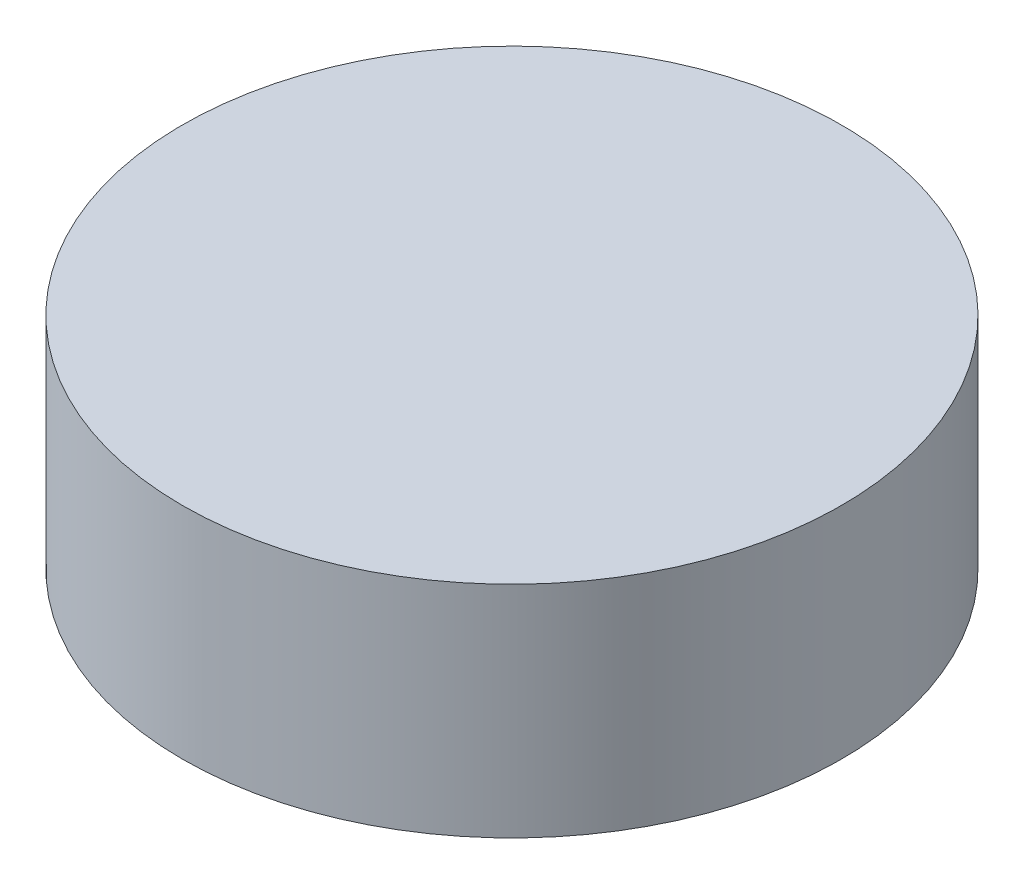
ISO-10303-21;
HEADER;
FILE_DESCRIPTION(('STEP AP214'),'2;1');
FILE_NAME('part.step','',(''),(''),'','','');
FILE_SCHEMA(('AUTOMOTIVE_DESIGN { 1 0 10303 214 1 1 1 1 }'));
ENDSEC;
DATA;
#1=APPLICATION_CONTEXT('core data for automotive mechanical design processes');
#2=APPLICATION_PROTOCOL_DEFINITION('international standard','automotive_design',2000,#1);
#3=PRODUCT_CONTEXT('',#1,'mechanical');
#4=PRODUCT('Part','Part','',(#3));
#5=PRODUCT_RELATED_PRODUCT_CATEGORY('part','',(#4));
#6=PRODUCT_DEFINITION_FORMATION('','',#4);
#7=PRODUCT_DEFINITION_CONTEXT('part definition',#1,'design');
#8=PRODUCT_DEFINITION('design','',#6,#7);
#9=PRODUCT_DEFINITION_SHAPE('','',#8);
#10=(LENGTH_UNIT() NAMED_UNIT(*) SI_UNIT(.MILLI.,.METRE.));
#11=(NAMED_UNIT(*) PLANE_ANGLE_UNIT() SI_UNIT($,.RADIAN.));
#12=(NAMED_UNIT(*) SI_UNIT($,.STERADIAN.) SOLID_ANGLE_UNIT());
#13=UNCERTAINTY_MEASURE_WITH_UNIT(LENGTH_MEASURE(1.E-05),#10,'distance_accuracy_value','');
#14=(GEOMETRIC_REPRESENTATION_CONTEXT(3) GLOBAL_UNCERTAINTY_ASSIGNED_CONTEXT((#13)) GLOBAL_UNIT_ASSIGNED_CONTEXT((#10,
#11,#12)) REPRESENTATION_CONTEXT('',''));
#15=CARTESIAN_POINT('',(0.,0.,0.));
#16=DIRECTION('',(0.,0.,1.));
#17=DIRECTION('',(1.,0.,0.));
#18=AXIS2_PLACEMENT_3D('',#15,#16,#17);
#19=CARTESIAN_POINT('',(0.,2.,0.));
#20=DIRECTION('',(0.,-1.,0.));
#21=DIRECTION('',(0.,0.,-1.));
#22=AXIS2_PLACEMENT_3D('',#19,#20,#21);
#23=CYLINDRICAL_SURFACE('',#22,3.);
#24=CARTESIAN_POINT('',(0.,2.,0.));
#25=DIRECTION('',(0.,1.,0.));
#26=DIRECTION('',(0.,0.,1.));
#27=AXIS2_PLACEMENT_3D('',#24,#25,#26);
#28=CIRCLE('',#27,3.);
#29=CARTESIAN_POINT('',(0.,2.,3.));
#30=VERTEX_POINT('',#29);
#31=EDGE_CURVE('E10',#30,#30,#28,.T.);
#32=ORIENTED_EDGE('',*,*,#31,.F.);
#33=EDGE_LOOP('',(#32));
#34=FACE_BOUND('',#33,.T.);
#35=CARTESIAN_POINT('',(0.,0.,0.));
#36=DIRECTION('',(0.,1.,0.));
#37=DIRECTION('',(0.,0.,1.));
#38=AXIS2_PLACEMENT_3D('',#35,#36,#37);
#39=CIRCLE('',#38,3.);
#40=CARTESIAN_POINT('',(0.,0.,3.));
#41=VERTEX_POINT('',#40);
#42=EDGE_CURVE('E41',#41,#41,#39,.T.);
#43=ORIENTED_EDGE('',*,*,#42,.T.);
#44=EDGE_LOOP('',(#43));
#45=FACE_BOUND('',#44,.T.);
#46=ADVANCED_FACE('F38',(#34,#45),#23,.T.);
#47=CARTESIAN_POINT('',(0.,2.,0.));
#48=DIRECTION('',(0.,1.,0.));
#49=DIRECTION('',(0.,0.,1.));
#50=AXIS2_PLACEMENT_3D('',#47,#48,#49);
#51=PLANE('',#50);
#52=ORIENTED_EDGE('',*,*,#31,.T.);
#53=EDGE_LOOP('',(#52));
#54=FACE_BOUND('',#53,.T.);
#55=ADVANCED_FACE('F55',(#54),#51,.T.);
#56=CARTESIAN_POINT('',(0.,0.,0.));
#57=DIRECTION('',(0.,1.,0.));
#58=DIRECTION('',(0.,0.,1.));
#59=AXIS2_PLACEMENT_3D('',#56,#57,#58);
#60=PLANE('',#59);
#61=ORIENTED_EDGE('',*,*,#42,.F.);
#62=EDGE_LOOP('',(#61));
#63=FACE_BOUND('',#62,.T.);
#64=ADVANCED_FACE('F53',(#63),#60,.F.);
#65=CLOSED_SHELL('',(#46,#55,#64));
#66=MANIFOLD_SOLID_BREP('B2',#65);
#67=ADVANCED_BREP_SHAPE_REPRESENTATION('',(#18,#66),#14);
#68=SHAPE_DEFINITION_REPRESENTATION(#9,#67);
ENDSEC;
END-ISO-10303-21;
